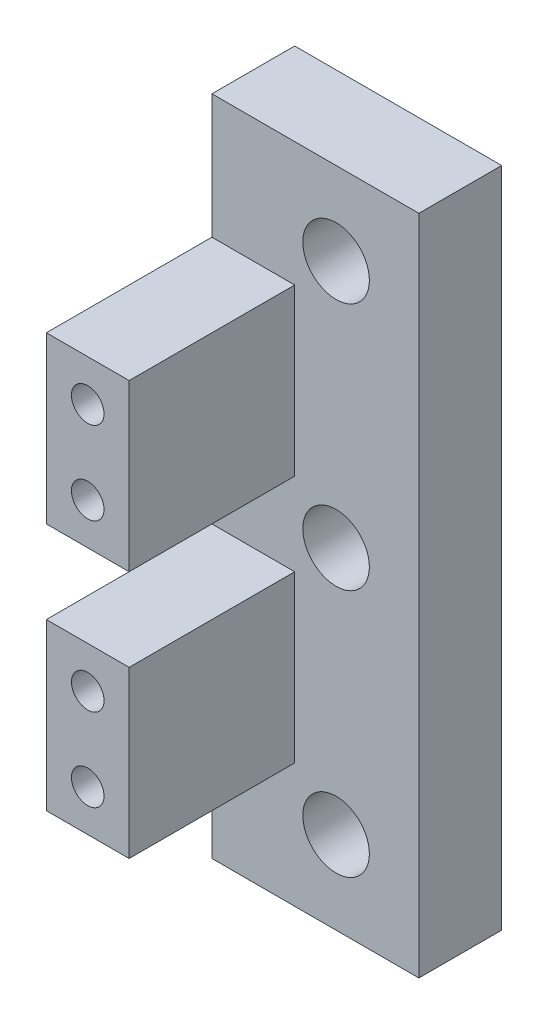
ISO-10303-21;
HEADER;
FILE_DESCRIPTION(('STEP AP214'),'2;1');
FILE_NAME('part.step','',(''),(''),'','','');
FILE_SCHEMA(('AUTOMOTIVE_DESIGN { 1 0 10303 214 1 1 1 1 }'));
ENDSEC;
DATA;
#1=APPLICATION_CONTEXT('core data for automotive mechanical design processes');
#2=APPLICATION_PROTOCOL_DEFINITION('international standard','automotive_design',2000,#1);
#3=PRODUCT_CONTEXT('',#1,'mechanical');
#4=PRODUCT('Part','Part','',(#3));
#5=PRODUCT_RELATED_PRODUCT_CATEGORY('part','',(#4));
#6=PRODUCT_DEFINITION_FORMATION('','',#4);
#7=PRODUCT_DEFINITION_CONTEXT('part definition',#1,'design');
#8=PRODUCT_DEFINITION('design','',#6,#7);
#9=PRODUCT_DEFINITION_SHAPE('','',#8);
#10=(LENGTH_UNIT() NAMED_UNIT(*) SI_UNIT(.MILLI.,.METRE.));
#11=(NAMED_UNIT(*) PLANE_ANGLE_UNIT() SI_UNIT($,.RADIAN.));
#12=(NAMED_UNIT(*) SI_UNIT($,.STERADIAN.) SOLID_ANGLE_UNIT());
#13=UNCERTAINTY_MEASURE_WITH_UNIT(LENGTH_MEASURE(1.E-05),#10,'distance_accuracy_value','');
#14=(GEOMETRIC_REPRESENTATION_CONTEXT(3) GLOBAL_UNCERTAINTY_ASSIGNED_CONTEXT((#13)) GLOBAL_UNIT_ASSIGNED_CONTEXT((#10,
#11,#12)) REPRESENTATION_CONTEXT('',''));
#15=CARTESIAN_POINT('',(0.,0.,0.));
#16=DIRECTION('',(0.,0.,1.));
#17=DIRECTION('',(1.,0.,0.));
#18=AXIS2_PLACEMENT_3D('',#15,#16,#17);
#19=CARTESIAN_POINT('',(6.35,50.8,6.35));
#20=DIRECTION('',(0.,0.,-1.));
#21=DIRECTION('',(-1.,0.,0.));
#22=AXIS2_PLACEMENT_3D('',#19,#20,#21);
#23=PLANE('',#22);
#24=DIRECTION('',(1.,0.,0.));
#25=VECTOR('',#24,1.);
#26=CARTESIAN_POINT('',(6.35,0.,6.35));
#27=LINE('',#26,#25);
#28=CARTESIAN_POINT('',(0.,0.,6.35));
#29=VERTEX_POINT('',#28);
#30=CARTESIAN_POINT('',(15.875,0.,6.35));
#31=VERTEX_POINT('',#30);
#32=EDGE_CURVE('E102',#29,#31,#27,.T.);
#33=ORIENTED_EDGE('',*,*,#32,.T.);
#34=DIRECTION('',(0.,-1.,0.));
#35=VECTOR('',#34,1.);
#36=CARTESIAN_POINT('',(15.875,50.8,6.35));
#37=LINE('',#36,#35);
#38=CARTESIAN_POINT('',(15.875,50.8,6.35));
#39=VERTEX_POINT('',#38);
#40=EDGE_CURVE('E208',#39,#31,#37,.T.);
#41=ORIENTED_EDGE('',*,*,#40,.F.);
#42=DIRECTION('',(1.,0.,0.));
#43=VECTOR('',#42,1.);
#44=CARTESIAN_POINT('',(6.35,50.8,6.35));
#45=LINE('',#44,#43);
#46=CARTESIAN_POINT('',(0.,50.8,6.35));
#47=VERTEX_POINT('',#46);
#48=EDGE_CURVE('E202',#47,#39,#45,.T.);
#49=ORIENTED_EDGE('',*,*,#48,.F.);
#50=DIRECTION('',(0.,1.,0.));
#51=VECTOR('',#50,1.);
#52=CARTESIAN_POINT('',(0.,50.8,6.35));
#53=LINE('',#52,#51);
#54=CARTESIAN_POINT('',(0.,41.275,6.35));
#55=VERTEX_POINT('',#54);
#56=EDGE_CURVE('E205',#55,#47,#53,.T.);
#57=ORIENTED_EDGE('',*,*,#56,.F.);
#58=DIRECTION('',(1.,0.,0.));
#59=VECTOR('',#58,1.);
#60=CARTESIAN_POINT('',(0.,41.275,6.35));
#61=LINE('',#60,#59);
#62=CARTESIAN_POINT('',(6.35,41.275,6.35));
#63=VERTEX_POINT('',#62);
#64=EDGE_CURVE('E353',#55,#63,#61,.T.);
#65=ORIENTED_EDGE('',*,*,#64,.T.);
#66=DIRECTION('',(0.,-1.,0.));
#67=VECTOR('',#66,1.);
#68=CARTESIAN_POINT('',(6.35,50.8,6.35));
#69=LINE('',#68,#67);
#70=CARTESIAN_POINT('',(6.35,28.575,6.35));
#71=VERTEX_POINT('',#70);
#72=EDGE_CURVE('E262',#63,#71,#69,.T.);
#73=ORIENTED_EDGE('',*,*,#72,.T.);
#74=DIRECTION('',(1.,0.,0.));
#75=VECTOR('',#74,1.);
#76=CARTESIAN_POINT('',(0.,28.575,6.35));
#77=LINE('',#76,#75);
#78=CARTESIAN_POINT('',(0.,28.575,6.35));
#79=VERTEX_POINT('',#78);
#80=EDGE_CURVE('E301',#79,#71,#77,.T.);
#81=ORIENTED_EDGE('',*,*,#80,.F.);
#82=DIRECTION('',(0.,1.,0.));
#83=VECTOR('',#82,1.);
#84=CARTESIAN_POINT('',(0.,28.575,6.35));
#85=LINE('',#84,#83);
#86=CARTESIAN_POINT('',(0.,22.225,6.35));
#87=VERTEX_POINT('',#86);
#88=EDGE_CURVE('E319',#87,#79,#85,.T.);
#89=ORIENTED_EDGE('',*,*,#88,.F.);
#90=DIRECTION('',(1.,0.,0.));
#91=VECTOR('',#90,1.);
#92=CARTESIAN_POINT('',(0.,22.225,6.35));
#93=LINE('',#92,#91);
#94=CARTESIAN_POINT('',(6.35,22.225,6.35));
#95=VERTEX_POINT('',#94);
#96=EDGE_CURVE('E310',#87,#95,#93,.T.);
#97=ORIENTED_EDGE('',*,*,#96,.T.);
#98=CARTESIAN_POINT('',(6.35,9.525,6.35));
#99=VERTEX_POINT('',#98);
#100=EDGE_CURVE('E258',#95,#99,#69,.T.);
#101=ORIENTED_EDGE('',*,*,#100,.T.);
#102=DIRECTION('',(1.,0.,0.));
#103=VECTOR('',#102,1.);
#104=CARTESIAN_POINT('',(0.,9.525,6.35));
#105=LINE('',#104,#103);
#106=CARTESIAN_POINT('',(0.,9.525,6.35));
#107=VERTEX_POINT('',#106);
#108=EDGE_CURVE('E331',#107,#99,#105,.T.);
#109=ORIENTED_EDGE('',*,*,#108,.F.);
#110=DIRECTION('',(0.,1.,0.));
#111=VECTOR('',#110,1.);
#112=CARTESIAN_POINT('',(0.,0.,6.35));
#113=LINE('',#112,#111);
#114=EDGE_CURVE('E341',#29,#107,#113,.T.);
#115=ORIENTED_EDGE('',*,*,#114,.F.);
#116=EDGE_LOOP('',(#33,#41,#49,#57,#65,#73,#81,#89,#97,#101,#109,#115));
#117=FACE_BOUND('',#116,.T.);
#118=CARTESIAN_POINT('',(9.525,44.45,6.35));
#119=DIRECTION('',(0.,0.,1.));
#120=DIRECTION('',(1.,0.,0.));
#121=AXIS2_PLACEMENT_3D('',#118,#119,#120);
#122=CIRCLE('',#121,2.55269999999999);
#123=CARTESIAN_POINT('',(12.0777,44.45,6.35));
#124=VERTEX_POINT('',#123);
#125=EDGE_CURVE('E497',#124,#124,#122,.T.);
#126=ORIENTED_EDGE('',*,*,#125,.F.);
#127=EDGE_LOOP('',(#126));
#128=FACE_BOUND('',#127,.T.);
#129=CARTESIAN_POINT('',(9.525,25.4,6.35));
#130=DIRECTION('',(0.,0.,1.));
#131=DIRECTION('',(1.,0.,0.));
#132=AXIS2_PLACEMENT_3D('',#129,#130,#131);
#133=CIRCLE('',#132,2.55269999999999);
#134=CARTESIAN_POINT('',(12.0777,25.4,6.35));
#135=VERTEX_POINT('',#134);
#136=EDGE_CURVE('E487',#135,#135,#133,.T.);
#137=ORIENTED_EDGE('',*,*,#136,.F.);
#138=EDGE_LOOP('',(#137));
#139=FACE_BOUND('',#138,.T.);
#140=CARTESIAN_POINT('',(9.525,6.35,6.35));
#141=DIRECTION('',(0.,0.,1.));
#142=DIRECTION('',(1.,0.,0.));
#143=AXIS2_PLACEMENT_3D('',#140,#141,#142);
#144=CIRCLE('',#143,2.55269999999999);
#145=CARTESIAN_POINT('',(12.0777,6.35,6.35));
#146=VERTEX_POINT('',#145);
#147=EDGE_CURVE('E480',#146,#146,#144,.T.);
#148=ORIENTED_EDGE('',*,*,#147,.F.);
#149=EDGE_LOOP('',(#148));
#150=FACE_BOUND('',#149,.T.);
#151=ADVANCED_FACE('F72',(#117,#128,#139,#150),#23,.F.);
#152=CARTESIAN_POINT('',(0.,50.8,19.05));
#153=DIRECTION('',(0.,0.,-1.));
#154=DIRECTION('',(-1.,0.,0.));
#155=AXIS2_PLACEMENT_3D('',#152,#153,#154);
#156=PLANE('',#155);
#157=CARTESIAN_POINT('',(3.17499999999996,19.05,19.05));
#158=DIRECTION('',(0.,0.,1.));
#159=DIRECTION('',(1.,0.,0.));
#160=AXIS2_PLACEMENT_3D('',#157,#158,#159);
#161=CIRCLE('',#160,1.24999999999999);
#162=CARTESIAN_POINT('',(4.42499999999995,19.05,19.05));
#163=VERTEX_POINT('',#162);
#164=EDGE_CURVE('E357',#163,#163,#161,.T.);
#165=ORIENTED_EDGE('',*,*,#164,.F.);
#166=EDGE_LOOP('',(#165));
#167=FACE_BOUND('',#166,.T.);
#168=CARTESIAN_POINT('',(3.17499999999998,12.7,19.05));
#169=DIRECTION('',(0.,0.,1.));
#170=DIRECTION('',(1.,0.,0.));
#171=AXIS2_PLACEMENT_3D('',#168,#169,#170);
#172=CIRCLE('',#171,1.24999999999999);
#173=CARTESIAN_POINT('',(4.42499999999997,12.7,19.05));
#174=VERTEX_POINT('',#173);
#175=EDGE_CURVE('E348',#174,#174,#172,.T.);
#176=ORIENTED_EDGE('',*,*,#175,.F.);
#177=EDGE_LOOP('',(#176));
#178=FACE_BOUND('',#177,.T.);
#179=DIRECTION('',(0.,-1.,0.));
#180=VECTOR('',#179,1.);
#181=CARTESIAN_POINT('',(6.35,50.8,19.05));
#182=LINE('',#181,#180);
#183=CARTESIAN_POINT('',(6.35,22.225,19.05));
#184=VERTEX_POINT('',#183);
#185=CARTESIAN_POINT('',(6.35,9.525,19.05));
#186=VERTEX_POINT('',#185);
#187=EDGE_CURVE('E263',#184,#186,#182,.T.);
#188=ORIENTED_EDGE('',*,*,#187,.F.);
#189=DIRECTION('',(1.,0.,0.));
#190=VECTOR('',#189,1.);
#191=CARTESIAN_POINT('',(0.,22.225,19.05));
#192=LINE('',#191,#190);
#193=CARTESIAN_POINT('',(0.,22.225,19.05));
#194=VERTEX_POINT('',#193);
#195=EDGE_CURVE('E302',#194,#184,#192,.T.);
#196=ORIENTED_EDGE('',*,*,#195,.F.);
#197=DIRECTION('',(0.,-1.,0.));
#198=VECTOR('',#197,1.);
#199=CARTESIAN_POINT('',(0.,50.8,19.05));
#200=LINE('',#199,#198);
#201=CARTESIAN_POINT('',(0.,9.525,19.05));
#202=VERTEX_POINT('',#201);
#203=EDGE_CURVE('E267',#194,#202,#200,.T.);
#204=ORIENTED_EDGE('',*,*,#203,.T.);
#205=DIRECTION('',(1.,0.,0.));
#206=VECTOR('',#205,1.);
#207=CARTESIAN_POINT('',(0.,9.525,19.05));
#208=LINE('',#207,#206);
#209=EDGE_CURVE('E335',#202,#186,#208,.T.);
#210=ORIENTED_EDGE('',*,*,#209,.T.);
#211=EDGE_LOOP('',(#188,#196,#204,#210));
#212=FACE_BOUND('',#211,.T.);
#213=ADVANCED_FACE('F394',(#167,#178,#212),#156,.F.);
#214=CARTESIAN_POINT('',(6.35,50.8,19.05));
#215=DIRECTION('',(-1.,0.,0.));
#216=DIRECTION('',(0.,0.,1.));
#217=AXIS2_PLACEMENT_3D('',#214,#215,#216);
#218=PLANE('',#217);
#219=ORIENTED_EDGE('',*,*,#100,.F.);
#220=DIRECTION('',(0.,0.,-1.));
#221=VECTOR('',#220,1.);
#222=CARTESIAN_POINT('',(6.35,22.225,6.35));
#223=LINE('',#222,#221);
#224=EDGE_CURVE('E91',#184,#95,#223,.T.);
#225=ORIENTED_EDGE('',*,*,#224,.F.);
#226=ORIENTED_EDGE('',*,*,#187,.T.);
#227=DIRECTION('',(0.,0.,1.));
#228=VECTOR('',#227,1.);
#229=CARTESIAN_POINT('',(6.35,9.525,6.35));
#230=LINE('',#229,#228);
#231=EDGE_CURVE('E316',#99,#186,#230,.T.);
#232=ORIENTED_EDGE('',*,*,#231,.F.);
#233=EDGE_LOOP('',(#219,#225,#226,#232));
#234=FACE_BOUND('',#233,.T.);
#235=ADVANCED_FACE('F402',(#234),#218,.F.);
#236=CARTESIAN_POINT('',(15.875,50.8,0.));
#237=DIRECTION('',(0.,0.,1.));
#238=DIRECTION('',(1.,0.,0.));
#239=AXIS2_PLACEMENT_3D('',#236,#237,#238);
#240=PLANE('',#239);
#241=CARTESIAN_POINT('',(9.525,6.35,0.));
#242=DIRECTION('',(0.,0.,1.));
#243=DIRECTION('',(1.,0.,0.));
#244=AXIS2_PLACEMENT_3D('',#241,#242,#243);
#245=CIRCLE('',#244,2.55269999999999);
#246=CARTESIAN_POINT('',(12.0777,6.35,0.));
#247=VERTEX_POINT('',#246);
#248=EDGE_CURVE('E477',#247,#247,#245,.T.);
#249=ORIENTED_EDGE('',*,*,#248,.T.);
#250=EDGE_LOOP('',(#249));
#251=FACE_BOUND('',#250,.T.);
#252=CARTESIAN_POINT('',(9.525,25.4,0.));
#253=DIRECTION('',(0.,0.,1.));
#254=DIRECTION('',(1.,0.,0.));
#255=AXIS2_PLACEMENT_3D('',#252,#253,#254);
#256=CIRCLE('',#255,2.55269999999999);
#257=CARTESIAN_POINT('',(12.0777,25.4,0.));
#258=VERTEX_POINT('',#257);
#259=EDGE_CURVE('E493',#258,#258,#256,.T.);
#260=ORIENTED_EDGE('',*,*,#259,.T.);
#261=EDGE_LOOP('',(#260));
#262=FACE_BOUND('',#261,.T.);
#263=CARTESIAN_POINT('',(9.525,44.45,0.));
#264=DIRECTION('',(0.,0.,1.));
#265=DIRECTION('',(1.,0.,0.));
#266=AXIS2_PLACEMENT_3D('',#263,#264,#265);
#267=CIRCLE('',#266,2.55269999999999);
#268=CARTESIAN_POINT('',(12.0777,44.45,0.));
#269=VERTEX_POINT('',#268);
#270=EDGE_CURVE('E338',#269,#269,#267,.T.);
#271=ORIENTED_EDGE('',*,*,#270,.T.);
#272=EDGE_LOOP('',(#271));
#273=FACE_BOUND('',#272,.T.);
#274=DIRECTION('',(-1.,0.,0.));
#275=VECTOR('',#274,1.);
#276=CARTESIAN_POINT('',(15.875,0.,0.));
#277=LINE('',#276,#275);
#278=CARTESIAN_POINT('',(15.875,0.,0.));
#279=VERTEX_POINT('',#278);
#280=CARTESIAN_POINT('',(0.,0.,0.));
#281=VERTEX_POINT('',#280);
#282=EDGE_CURVE('E240',#279,#281,#277,.T.);
#283=ORIENTED_EDGE('',*,*,#282,.T.);
#284=DIRECTION('',(0.,-1.,0.));
#285=VECTOR('',#284,1.);
#286=CARTESIAN_POINT('',(0.,50.8,0.));
#287=LINE('',#286,#285);
#288=CARTESIAN_POINT('',(0.,50.8,0.));
#289=VERTEX_POINT('',#288);
#290=EDGE_CURVE('E13',#289,#281,#287,.T.);
#291=ORIENTED_EDGE('',*,*,#290,.F.);
#292=DIRECTION('',(-1.,0.,0.));
#293=VECTOR('',#292,1.);
#294=CARTESIAN_POINT('',(15.875,50.8,0.));
#295=LINE('',#294,#293);
#296=CARTESIAN_POINT('',(15.875,50.8,0.));
#297=VERTEX_POINT('',#296);
#298=EDGE_CURVE('E226',#297,#289,#295,.T.);
#299=ORIENTED_EDGE('',*,*,#298,.F.);
#300=DIRECTION('',(0.,-1.,0.));
#301=VECTOR('',#300,1.);
#302=CARTESIAN_POINT('',(15.875,50.8,0.));
#303=LINE('',#302,#301);
#304=EDGE_CURVE('E239',#297,#279,#303,.T.);
#305=ORIENTED_EDGE('',*,*,#304,.T.);
#306=EDGE_LOOP('',(#283,#291,#299,#305));
#307=FACE_BOUND('',#306,.T.);
#308=ADVANCED_FACE('F74',(#251,#262,#273,#307),#240,.F.);
#309=CARTESIAN_POINT('',(0.,50.8,0.));
#310=DIRECTION('',(1.,0.,0.));
#311=DIRECTION('',(0.,0.,-1.));
#312=AXIS2_PLACEMENT_3D('',#309,#310,#311);
#313=PLANE('',#312);
#314=DIRECTION('',(0.,0.,-1.));
#315=VECTOR('',#314,1.);
#316=CARTESIAN_POINT('',(0.,41.275,6.35));
#317=LINE('',#316,#315);
#318=CARTESIAN_POINT('',(0.,41.275,19.05));
#319=VERTEX_POINT('',#318);
#320=EDGE_CURVE('E220',#319,#55,#317,.T.);
#321=ORIENTED_EDGE('',*,*,#320,.T.);
#322=ORIENTED_EDGE('',*,*,#56,.T.);
#323=DIRECTION('',(0.,0.,1.));
#324=VECTOR('',#323,1.);
#325=CARTESIAN_POINT('',(0.,50.8,0.));
#326=LINE('',#325,#324);
#327=EDGE_CURVE('E214',#289,#47,#326,.T.);
#328=ORIENTED_EDGE('',*,*,#327,.F.);
#329=ORIENTED_EDGE('',*,*,#290,.T.);
#330=DIRECTION('',(0.,0.,1.));
#331=VECTOR('',#330,1.);
#332=CARTESIAN_POINT('',(0.,0.,0.));
#333=LINE('',#332,#331);
#334=EDGE_CURVE('E244',#281,#29,#333,.T.);
#335=ORIENTED_EDGE('',*,*,#334,.T.);
#336=ORIENTED_EDGE('',*,*,#114,.T.);
#337=DIRECTION('',(0.,0.,1.));
#338=VECTOR('',#337,1.);
#339=CARTESIAN_POINT('',(0.,9.525,6.35));
#340=LINE('',#339,#338);
#341=EDGE_CURVE('E334',#107,#202,#340,.T.);
#342=ORIENTED_EDGE('',*,*,#341,.T.);
#343=ORIENTED_EDGE('',*,*,#203,.F.);
#344=DIRECTION('',(0.,0.,-1.));
#345=VECTOR('',#344,1.);
#346=CARTESIAN_POINT('',(0.,22.225,6.35));
#347=LINE('',#346,#345);
#348=EDGE_CURVE('E308',#194,#87,#347,.T.);
#349=ORIENTED_EDGE('',*,*,#348,.T.);
#350=ORIENTED_EDGE('',*,*,#88,.T.);
#351=DIRECTION('',(0.,0.,1.));
#352=VECTOR('',#351,1.);
#353=CARTESIAN_POINT('',(0.,28.575,6.35));
#354=LINE('',#353,#352);
#355=CARTESIAN_POINT('',(0.,28.575,19.05));
#356=VERTEX_POINT('',#355);
#357=EDGE_CURVE('E325',#79,#356,#354,.T.);
#358=ORIENTED_EDGE('',*,*,#357,.T.);
#359=EDGE_CURVE('E81',#319,#356,#200,.T.);
#360=ORIENTED_EDGE('',*,*,#359,.F.);
#361=EDGE_LOOP('',(#321,#322,#328,#329,#335,#336,#342,#343,#349,#350,#358,#360));
#362=FACE_BOUND('',#361,.T.);
#363=ADVANCED_FACE('F217',(#362),#313,.F.);
#364=CARTESIAN_POINT('',(3.17499999999992,31.75,19.05));
#365=DIRECTION('',(0.,0.,1.));
#366=DIRECTION('',(1.,0.,0.));
#367=AXIS2_PLACEMENT_3D('',#364,#365,#366);
#368=CIRCLE('',#367,1.24999999999999);
#369=CARTESIAN_POINT('',(4.42499999999991,31.75,19.05));
#370=VERTEX_POINT('',#369);
#371=EDGE_CURVE('E365',#370,#370,#368,.T.);
#372=ORIENTED_EDGE('',*,*,#371,.F.);
#373=EDGE_LOOP('',(#372));
#374=FACE_BOUND('',#373,.T.);
#375=CARTESIAN_POINT('',(3.1749999999999,38.1,19.05));
#376=DIRECTION('',(0.,0.,1.));
#377=DIRECTION('',(1.,0.,0.));
#378=AXIS2_PLACEMENT_3D('',#375,#376,#377);
#379=CIRCLE('',#378,1.24999999999999);
#380=CARTESIAN_POINT('',(4.42499999999988,38.1,19.05));
#381=VERTEX_POINT('',#380);
#382=EDGE_CURVE('E373',#381,#381,#379,.T.);
#383=ORIENTED_EDGE('',*,*,#382,.F.);
#384=EDGE_LOOP('',(#383));
#385=FACE_BOUND('',#384,.T.);
#386=CARTESIAN_POINT('',(6.35,41.275,19.05));
#387=VERTEX_POINT('',#386);
#388=CARTESIAN_POINT('',(6.35,28.575,19.05));
#389=VERTEX_POINT('',#388);
#390=EDGE_CURVE('E266',#387,#389,#182,.T.);
#391=ORIENTED_EDGE('',*,*,#390,.F.);
#392=DIRECTION('',(1.,0.,0.));
#393=VECTOR('',#392,1.);
#394=CARTESIAN_POINT('',(0.,41.275,19.05));
#395=LINE('',#394,#393);
#396=EDGE_CURVE('E295',#319,#387,#395,.T.);
#397=ORIENTED_EDGE('',*,*,#396,.F.);
#398=ORIENTED_EDGE('',*,*,#359,.T.);
#399=DIRECTION('',(1.,0.,0.));
#400=VECTOR('',#399,1.);
#401=CARTESIAN_POINT('',(0.,28.575,19.05));
#402=LINE('',#401,#400);
#403=EDGE_CURVE('E296',#356,#389,#402,.T.);
#404=ORIENTED_EDGE('',*,*,#403,.T.);
#405=EDGE_LOOP('',(#391,#397,#398,#404));
#406=FACE_BOUND('',#405,.T.);
#407=ADVANCED_FACE('F294',(#374,#385,#406),#156,.F.);
#408=ORIENTED_EDGE('',*,*,#72,.F.);
#409=DIRECTION('',(0.,0.,-1.));
#410=VECTOR('',#409,1.);
#411=CARTESIAN_POINT('',(6.35,41.275,6.35));
#412=LINE('',#411,#410);
#413=EDGE_CURVE('E222',#387,#63,#412,.T.);
#414=ORIENTED_EDGE('',*,*,#413,.F.);
#415=ORIENTED_EDGE('',*,*,#390,.T.);
#416=DIRECTION('',(0.,0.,1.));
#417=VECTOR('',#416,1.);
#418=CARTESIAN_POINT('',(6.35,28.575,6.35));
#419=LINE('',#418,#417);
#420=EDGE_CURVE('E288',#71,#389,#419,.T.);
#421=ORIENTED_EDGE('',*,*,#420,.F.);
#422=EDGE_LOOP('',(#408,#414,#415,#421));
#423=FACE_BOUND('',#422,.T.);
#424=ADVANCED_FACE('F287',(#423),#218,.F.);
#425=CARTESIAN_POINT('',(15.875,50.8,6.35));
#426=DIRECTION('',(-1.,0.,0.));
#427=DIRECTION('',(0.,0.,1.));
#428=AXIS2_PLACEMENT_3D('',#425,#426,#427);
#429=PLANE('',#428);
#430=DIRECTION('',(0.,0.,-1.));
#431=VECTOR('',#430,1.);
#432=CARTESIAN_POINT('',(15.875,0.,6.35));
#433=LINE('',#432,#431);
#434=EDGE_CURVE('E233',#31,#279,#433,.T.);
#435=ORIENTED_EDGE('',*,*,#434,.T.);
#436=ORIENTED_EDGE('',*,*,#304,.F.);
#437=DIRECTION('',(0.,0.,-1.));
#438=VECTOR('',#437,1.);
#439=CARTESIAN_POINT('',(15.875,50.8,6.35));
#440=LINE('',#439,#438);
#441=EDGE_CURVE('E213',#39,#297,#440,.T.);
#442=ORIENTED_EDGE('',*,*,#441,.F.);
#443=ORIENTED_EDGE('',*,*,#40,.T.);
#444=EDGE_LOOP('',(#435,#436,#442,#443));
#445=FACE_BOUND('',#444,.T.);
#446=ADVANCED_FACE('F400',(#445),#429,.F.);
#447=CARTESIAN_POINT('',(0.,50.8,0.));
#448=DIRECTION('',(0.,1.,0.));
#449=DIRECTION('',(0.,0.,1.));
#450=AXIS2_PLACEMENT_3D('',#447,#448,#449);
#451=PLANE('',#450);
#452=ORIENTED_EDGE('',*,*,#327,.T.);
#453=ORIENTED_EDGE('',*,*,#48,.T.);
#454=ORIENTED_EDGE('',*,*,#441,.T.);
#455=ORIENTED_EDGE('',*,*,#298,.T.);
#456=EDGE_LOOP('',(#452,#453,#454,#455));
#457=FACE_BOUND('',#456,.T.);
#458=ADVANCED_FACE('F224',(#457),#451,.T.);
#459=CARTESIAN_POINT('',(0.,0.,0.));
#460=DIRECTION('',(0.,1.,0.));
#461=DIRECTION('',(0.,0.,1.));
#462=AXIS2_PLACEMENT_3D('',#459,#460,#461);
#463=PLANE('',#462);
#464=ORIENTED_EDGE('',*,*,#32,.F.);
#465=ORIENTED_EDGE('',*,*,#334,.F.);
#466=ORIENTED_EDGE('',*,*,#282,.F.);
#467=ORIENTED_EDGE('',*,*,#434,.F.);
#468=EDGE_LOOP('',(#464,#465,#466,#467));
#469=FACE_BOUND('',#468,.T.);
#470=ADVANCED_FACE('F417',(#469),#463,.F.);
#471=CARTESIAN_POINT('',(3.1749999999999,38.1,11.557));
#472=DIRECTION('',(0.,0.,1.));
#473=DIRECTION('',(1.,0.,0.));
#474=AXIS2_PLACEMENT_3D('',#471,#472,#473);
#475=CONICAL_SURFACE('',#474,1.24999999999999,1.02974425867665);
#476=CARTESIAN_POINT('',(3.17499999999989,38.1,10.8059242262156));
#477=VERTEX_POINT('',#476);
#478=VERTEX_LOOP('',#477);
#479=FACE_BOUND('',#478,.T.);
#480=CARTESIAN_POINT('',(3.1749999999999,38.1,11.557));
#481=DIRECTION('',(0.,0.,1.));
#482=DIRECTION('',(1.,0.,0.));
#483=AXIS2_PLACEMENT_3D('',#480,#481,#482);
#484=CIRCLE('',#483,1.24999999999999);
#485=CARTESIAN_POINT('',(4.42499999999988,38.1,11.557));
#486=VERTEX_POINT('',#485);
#487=EDGE_CURVE('E245',#486,#486,#484,.T.);
#488=ORIENTED_EDGE('',*,*,#487,.T.);
#489=EDGE_LOOP('',(#488));
#490=FACE_BOUND('',#489,.T.);
#491=ADVANCED_FACE('F382',(#479,#490),#475,.F.);
#492=CARTESIAN_POINT('',(3.1749999999999,38.1,19.05));
#493=DIRECTION('',(0.,0.,1.));
#494=DIRECTION('',(1.,0.,0.));
#495=AXIS2_PLACEMENT_3D('',#492,#493,#494);
#496=CYLINDRICAL_SURFACE('',#495,1.24999999999999);
#497=ORIENTED_EDGE('',*,*,#487,.F.);
#498=EDGE_LOOP('',(#497));
#499=FACE_BOUND('',#498,.T.);
#500=ORIENTED_EDGE('',*,*,#382,.T.);
#501=EDGE_LOOP('',(#500));
#502=FACE_BOUND('',#501,.T.);
#503=ADVANCED_FACE('F384',(#499,#502),#496,.F.);
#504=CARTESIAN_POINT('',(3.17499999999992,31.75,11.557));
#505=DIRECTION('',(0.,0.,1.));
#506=DIRECTION('',(1.,0.,0.));
#507=AXIS2_PLACEMENT_3D('',#504,#505,#506);
#508=CONICAL_SURFACE('',#507,1.24999999999999,1.02974425867665);
#509=CARTESIAN_POINT('',(3.17499999999991,31.75,10.8059242262156));
#510=VERTEX_POINT('',#509);
#511=VERTEX_LOOP('',#510);
#512=FACE_BOUND('',#511,.T.);
#513=CARTESIAN_POINT('',(3.17499999999992,31.75,11.557));
#514=DIRECTION('',(0.,0.,1.));
#515=DIRECTION('',(1.,0.,0.));
#516=AXIS2_PLACEMENT_3D('',#513,#514,#515);
#517=CIRCLE('',#516,1.24999999999999);
#518=CARTESIAN_POINT('',(4.4249999999999,31.75,11.557));
#519=VERTEX_POINT('',#518);
#520=EDGE_CURVE('E369',#519,#519,#517,.T.);
#521=ORIENTED_EDGE('',*,*,#520,.T.);
#522=EDGE_LOOP('',(#521));
#523=FACE_BOUND('',#522,.T.);
#524=ADVANCED_FACE('F387',(#512,#523),#508,.F.);
#525=CARTESIAN_POINT('',(3.17499999999992,31.75,19.05));
#526=DIRECTION('',(0.,0.,1.));
#527=DIRECTION('',(1.,0.,0.));
#528=AXIS2_PLACEMENT_3D('',#525,#526,#527);
#529=CYLINDRICAL_SURFACE('',#528,1.24999999999999);
#530=ORIENTED_EDGE('',*,*,#520,.F.);
#531=EDGE_LOOP('',(#530));
#532=FACE_BOUND('',#531,.T.);
#533=ORIENTED_EDGE('',*,*,#371,.T.);
#534=EDGE_LOOP('',(#533));
#535=FACE_BOUND('',#534,.T.);
#536=ADVANCED_FACE('F427',(#532,#535),#529,.F.);
#537=CARTESIAN_POINT('',(3.17499999999996,19.05,11.557));
#538=DIRECTION('',(0.,0.,1.));
#539=DIRECTION('',(1.,0.,0.));
#540=AXIS2_PLACEMENT_3D('',#537,#538,#539);
#541=CONICAL_SURFACE('',#540,1.24999999999999,1.02974425867665);
#542=CARTESIAN_POINT('',(3.17499999999996,19.05,10.8059242262156));
#543=VERTEX_POINT('',#542);
#544=VERTEX_LOOP('',#543);
#545=FACE_BOUND('',#544,.T.);
#546=CARTESIAN_POINT('',(3.17499999999996,19.05,11.557));
#547=DIRECTION('',(0.,0.,1.));
#548=DIRECTION('',(1.,0.,0.));
#549=AXIS2_PLACEMENT_3D('',#546,#547,#548);
#550=CIRCLE('',#549,1.24999999999999);
#551=CARTESIAN_POINT('',(4.42499999999995,19.05,11.557));
#552=VERTEX_POINT('',#551);
#553=EDGE_CURVE('E361',#552,#552,#550,.T.);
#554=ORIENTED_EDGE('',*,*,#553,.T.);
#555=EDGE_LOOP('',(#554));
#556=FACE_BOUND('',#555,.T.);
#557=ADVANCED_FACE('F431',(#545,#556),#541,.F.);
#558=CARTESIAN_POINT('',(3.17499999999996,19.05,19.05));
#559=DIRECTION('',(0.,0.,1.));
#560=DIRECTION('',(1.,0.,0.));
#561=AXIS2_PLACEMENT_3D('',#558,#559,#560);
#562=CYLINDRICAL_SURFACE('',#561,1.24999999999999);
#563=ORIENTED_EDGE('',*,*,#553,.F.);
#564=EDGE_LOOP('',(#563));
#565=FACE_BOUND('',#564,.T.);
#566=ORIENTED_EDGE('',*,*,#164,.T.);
#567=EDGE_LOOP('',(#566));
#568=FACE_BOUND('',#567,.T.);
#569=ADVANCED_FACE('F435',(#565,#568),#562,.F.);
#570=CARTESIAN_POINT('',(3.17499999999998,12.7,11.557));
#571=DIRECTION('',(0.,0.,1.));
#572=DIRECTION('',(1.,0.,0.));
#573=AXIS2_PLACEMENT_3D('',#570,#571,#572);
#574=CONICAL_SURFACE('',#573,1.24999999999999,1.02974425867665);
#575=CARTESIAN_POINT('',(3.17499999999998,12.7,10.8059242262156));
#576=VERTEX_POINT('',#575);
#577=VERTEX_LOOP('',#576);
#578=FACE_BOUND('',#577,.T.);
#579=CARTESIAN_POINT('',(3.17499999999998,12.7,11.557));
#580=DIRECTION('',(0.,0.,1.));
#581=DIRECTION('',(1.,0.,0.));
#582=AXIS2_PLACEMENT_3D('',#579,#580,#581);
#583=CIRCLE('',#582,1.24999999999999);
#584=CARTESIAN_POINT('',(4.42499999999997,12.7,11.557));
#585=VERTEX_POINT('',#584);
#586=EDGE_CURVE('E352',#585,#585,#583,.T.);
#587=ORIENTED_EDGE('',*,*,#586,.T.);
#588=EDGE_LOOP('',(#587));
#589=FACE_BOUND('',#588,.T.);
#590=ADVANCED_FACE('F439',(#578,#589),#574,.F.);
#591=CARTESIAN_POINT('',(3.17499999999998,12.7,19.05));
#592=DIRECTION('',(0.,0.,1.));
#593=DIRECTION('',(1.,0.,0.));
#594=AXIS2_PLACEMENT_3D('',#591,#592,#593);
#595=CYLINDRICAL_SURFACE('',#594,1.24999999999999);
#596=ORIENTED_EDGE('',*,*,#586,.F.);
#597=EDGE_LOOP('',(#596));
#598=FACE_BOUND('',#597,.T.);
#599=ORIENTED_EDGE('',*,*,#175,.T.);
#600=EDGE_LOOP('',(#599));
#601=FACE_BOUND('',#600,.T.);
#602=ADVANCED_FACE('F443',(#598,#601),#595,.F.);
#603=CARTESIAN_POINT('',(0.,9.525,6.35));
#604=DIRECTION('',(0.,1.,0.));
#605=DIRECTION('',(0.,0.,1.));
#606=AXIS2_PLACEMENT_3D('',#603,#604,#605);
#607=PLANE('',#606);
#608=ORIENTED_EDGE('',*,*,#231,.T.);
#609=ORIENTED_EDGE('',*,*,#209,.F.);
#610=ORIENTED_EDGE('',*,*,#341,.F.);
#611=ORIENTED_EDGE('',*,*,#108,.T.);
#612=EDGE_LOOP('',(#608,#609,#610,#611));
#613=FACE_BOUND('',#612,.T.);
#614=ADVANCED_FACE('F447',(#613),#607,.F.);
#615=CARTESIAN_POINT('',(0.,41.275,6.35));
#616=DIRECTION('',(0.,-1.,0.));
#617=DIRECTION('',(0.,0.,-1.));
#618=AXIS2_PLACEMENT_3D('',#615,#616,#617);
#619=PLANE('',#618);
#620=ORIENTED_EDGE('',*,*,#413,.T.);
#621=ORIENTED_EDGE('',*,*,#64,.F.);
#622=ORIENTED_EDGE('',*,*,#320,.F.);
#623=ORIENTED_EDGE('',*,*,#396,.T.);
#624=EDGE_LOOP('',(#620,#621,#622,#623));
#625=FACE_BOUND('',#624,.T.);
#626=ADVANCED_FACE('F451',(#625),#619,.F.);
#627=CARTESIAN_POINT('',(0.,22.225,6.35));
#628=DIRECTION('',(0.,-1.,0.));
#629=DIRECTION('',(0.,0.,-1.));
#630=AXIS2_PLACEMENT_3D('',#627,#628,#629);
#631=PLANE('',#630);
#632=ORIENTED_EDGE('',*,*,#224,.T.);
#633=ORIENTED_EDGE('',*,*,#96,.F.);
#634=ORIENTED_EDGE('',*,*,#348,.F.);
#635=ORIENTED_EDGE('',*,*,#195,.T.);
#636=EDGE_LOOP('',(#632,#633,#634,#635));
#637=FACE_BOUND('',#636,.T.);
#638=ADVANCED_FACE('F453',(#637),#631,.F.);
#639=CARTESIAN_POINT('',(0.,28.575,6.35));
#640=DIRECTION('',(0.,1.,0.));
#641=DIRECTION('',(0.,0.,1.));
#642=AXIS2_PLACEMENT_3D('',#639,#640,#641);
#643=PLANE('',#642);
#644=ORIENTED_EDGE('',*,*,#420,.T.);
#645=ORIENTED_EDGE('',*,*,#403,.F.);
#646=ORIENTED_EDGE('',*,*,#357,.F.);
#647=ORIENTED_EDGE('',*,*,#80,.T.);
#648=EDGE_LOOP('',(#644,#645,#646,#647));
#649=FACE_BOUND('',#648,.T.);
#650=ADVANCED_FACE('F456',(#649),#643,.F.);
#651=CARTESIAN_POINT('',(9.525,44.45,6.35));
#652=DIRECTION('',(0.,0.,1.));
#653=DIRECTION('',(1.,0.,0.));
#654=AXIS2_PLACEMENT_3D('',#651,#652,#653);
#655=CYLINDRICAL_SURFACE('',#654,2.55269999999999);
#656=ORIENTED_EDGE('',*,*,#270,.F.);
#657=EDGE_LOOP('',(#656));
#658=FACE_BOUND('',#657,.T.);
#659=ORIENTED_EDGE('',*,*,#125,.T.);
#660=EDGE_LOOP('',(#659));
#661=FACE_BOUND('',#660,.T.);
#662=ADVANCED_FACE('F458',(#658,#661),#655,.F.);
#663=CARTESIAN_POINT('',(9.525,25.4,6.35));
#664=DIRECTION('',(0.,0.,1.));
#665=DIRECTION('',(1.,0.,0.));
#666=AXIS2_PLACEMENT_3D('',#663,#664,#665);
#667=CYLINDRICAL_SURFACE('',#666,2.55269999999999);
#668=ORIENTED_EDGE('',*,*,#259,.F.);
#669=EDGE_LOOP('',(#668));
#670=FACE_BOUND('',#669,.T.);
#671=ORIENTED_EDGE('',*,*,#136,.T.);
#672=EDGE_LOOP('',(#671));
#673=FACE_BOUND('',#672,.T.);
#674=ADVANCED_FACE('F464',(#670,#673),#667,.F.);
#675=CARTESIAN_POINT('',(9.525,6.35,6.35));
#676=DIRECTION('',(0.,0.,1.));
#677=DIRECTION('',(1.,0.,0.));
#678=AXIS2_PLACEMENT_3D('',#675,#676,#677);
#679=CYLINDRICAL_SURFACE('',#678,2.55269999999999);
#680=ORIENTED_EDGE('',*,*,#248,.F.);
#681=EDGE_LOOP('',(#680));
#682=FACE_BOUND('',#681,.T.);
#683=ORIENTED_EDGE('',*,*,#147,.T.);
#684=EDGE_LOOP('',(#683));
#685=FACE_BOUND('',#684,.T.);
#686=ADVANCED_FACE('F468',(#682,#685),#679,.F.);
#687=CLOSED_SHELL('',(#151,#213,#235,#308,#363,#407,#424,#446,#458,#470,#491,#503,#524,#536,
#557,#569,#590,#602,#614,#626,#638,#650,#662,#674,#686));
#688=MANIFOLD_SOLID_BREP('B2',#687);
#689=ADVANCED_BREP_SHAPE_REPRESENTATION('',(#18,#688),#14);
#690=SHAPE_DEFINITION_REPRESENTATION(#9,#689);
ENDSEC;
END-ISO-10303-21;
